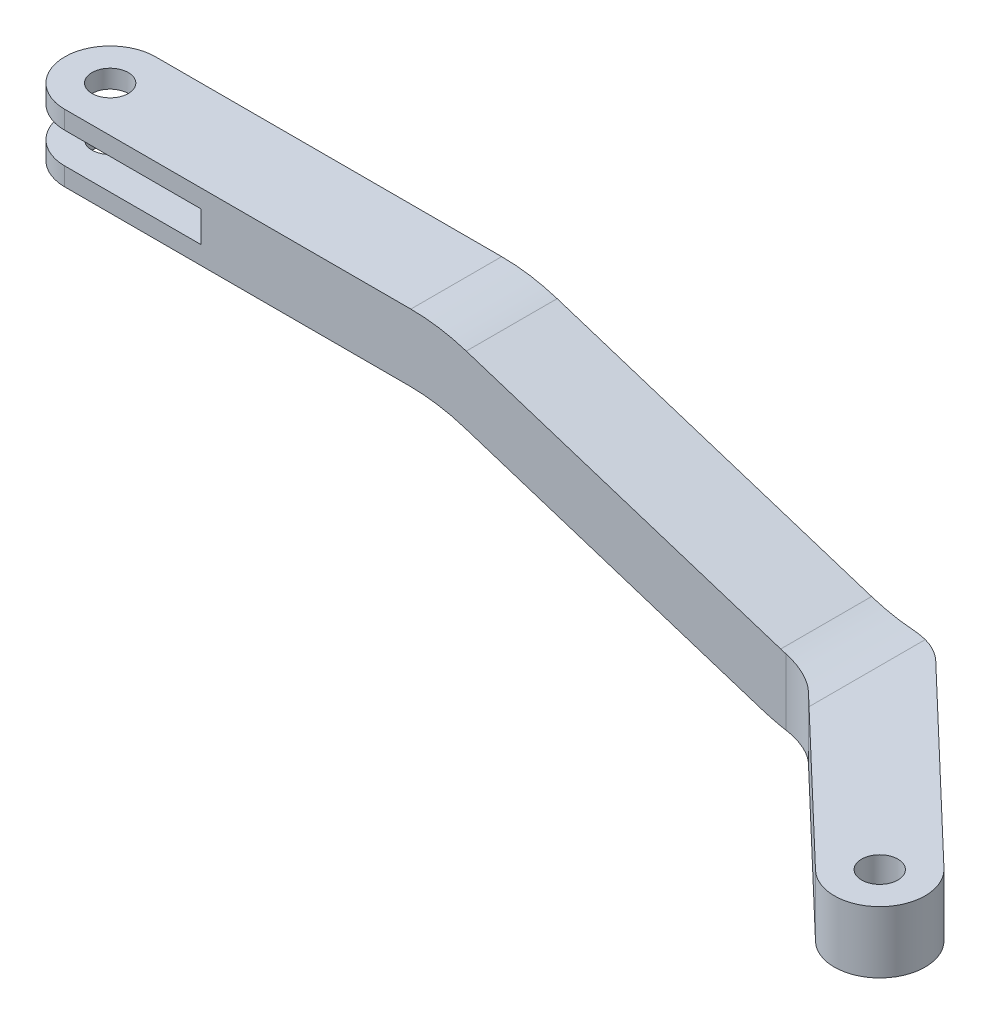
ISO-10303-21;
HEADER;
FILE_DESCRIPTION(('STEP AP214'),'2;1');
FILE_NAME('part.step','',(''),(''),'','','');
FILE_SCHEMA(('AUTOMOTIVE_DESIGN { 1 0 10303 214 1 1 1 1 }'));
ENDSEC;
DATA;
#1=APPLICATION_CONTEXT('core data for automotive mechanical design processes');
#2=APPLICATION_PROTOCOL_DEFINITION('international standard','automotive_design',2000,#1);
#3=PRODUCT_CONTEXT('',#1,'mechanical');
#4=PRODUCT('Part','Part','',(#3));
#5=PRODUCT_RELATED_PRODUCT_CATEGORY('part','',(#4));
#6=PRODUCT_DEFINITION_FORMATION('','',#4);
#7=PRODUCT_DEFINITION_CONTEXT('part definition',#1,'design');
#8=PRODUCT_DEFINITION('design','',#6,#7);
#9=PRODUCT_DEFINITION_SHAPE('','',#8);
#10=(LENGTH_UNIT() NAMED_UNIT(*) SI_UNIT(.MILLI.,.METRE.));
#11=(NAMED_UNIT(*) PLANE_ANGLE_UNIT() SI_UNIT($,.RADIAN.));
#12=(NAMED_UNIT(*) SI_UNIT($,.STERADIAN.) SOLID_ANGLE_UNIT());
#13=UNCERTAINTY_MEASURE_WITH_UNIT(LENGTH_MEASURE(1.E-05),#10,'distance_accuracy_value','');
#14=(GEOMETRIC_REPRESENTATION_CONTEXT(3) GLOBAL_UNCERTAINTY_ASSIGNED_CONTEXT((#13)) GLOBAL_UNIT_ASSIGNED_CONTEXT((#10,
#11,#12)) REPRESENTATION_CONTEXT('',''));
#15=CARTESIAN_POINT('',(0.,0.,0.));
#16=DIRECTION('',(0.,0.,1.));
#17=DIRECTION('',(1.,0.,0.));
#18=AXIS2_PLACEMENT_3D('',#15,#16,#17);
#19=CARTESIAN_POINT('',(-12.2120367770915,-3.4,0.));
#20=DIRECTION('',(0.,1.,0.));
#21=DIRECTION('',(-1.,0.,0.));
#22=AXIS2_PLACEMENT_3D('',#19,#20,#21);
#23=CYLINDRICAL_SURFACE('',#22,2.5);
#24=CARTESIAN_POINT('',(-12.2120367770915,5.5,0.));
#25=DIRECTION('',(0.,1.,0.));
#26=DIRECTION('',(-1.,0.,0.));
#27=AXIS2_PLACEMENT_3D('',#24,#25,#26);
#28=CIRCLE('',#27,2.5);
#29=CARTESIAN_POINT('',(-12.2120367770915,5.5,-2.5));
#30=VERTEX_POINT('',#29);
#31=CARTESIAN_POINT('',(-12.2120367770915,5.5,2.5));
#32=VERTEX_POINT('',#31);
#33=EDGE_CURVE('E342',#30,#32,#28,.T.);
#34=ORIENTED_EDGE('',*,*,#33,.T.);
#35=DIRECTION('',(0.,1.,0.));
#36=VECTOR('',#35,1.);
#37=CARTESIAN_POINT('',(-12.2120367770915,-3.4,2.5));
#38=LINE('',#37,#36);
#39=CARTESIAN_POINT('',(-12.2120367770915,6.5,2.5));
#40=VERTEX_POINT('',#39);
#41=EDGE_CURVE('E313',#32,#40,#38,.T.);
#42=ORIENTED_EDGE('',*,*,#41,.T.);
#43=CARTESIAN_POINT('',(-12.2120367770915,6.5,0.));
#44=DIRECTION('',(0.,1.,0.));
#45=DIRECTION('',(0.,0.,1.));
#46=AXIS2_PLACEMENT_3D('',#43,#44,#45);
#47=CIRCLE('',#46,2.5);
#48=CARTESIAN_POINT('',(-12.2120367770915,6.5,-2.5));
#49=VERTEX_POINT('',#48);
#50=EDGE_CURVE('E272',#49,#40,#47,.T.);
#51=ORIENTED_EDGE('',*,*,#50,.F.);
#52=DIRECTION('',(0.,1.,0.));
#53=VECTOR('',#52,1.);
#54=CARTESIAN_POINT('',(-12.2120367770915,-3.4,-2.5));
#55=LINE('',#54,#53);
#56=EDGE_CURVE('E310',#30,#49,#55,.T.);
#57=ORIENTED_EDGE('',*,*,#56,.F.);
#58=EDGE_LOOP('',(#34,#42,#51,#57));
#59=FACE_BOUND('',#58,.T.);
#60=ADVANCED_FACE('F75',(#59),#23,.T.);
#61=CARTESIAN_POINT('',(-14.7120367770915,6.5,2.5));
#62=DIRECTION('',(0.,-1.,0.));
#63=DIRECTION('',(0.,0.,-1.));
#64=AXIS2_PLACEMENT_3D('',#61,#62,#63);
#65=PLANE('',#64);
#66=CARTESIAN_POINT('',(-12.2120367770915,6.5,0.));
#67=DIRECTION('',(0.,1.,0.));
#68=DIRECTION('',(0.,0.,1.));
#69=AXIS2_PLACEMENT_3D('',#66,#67,#68);
#70=CIRCLE('',#69,1.);
#71=CARTESIAN_POINT('',(-12.2120367770915,6.5,1.));
#72=VERTEX_POINT('',#71);
#73=EDGE_CURVE('E351',#72,#72,#70,.T.);
#74=ORIENTED_EDGE('',*,*,#73,.F.);
#75=EDGE_LOOP('',(#74));
#76=FACE_BOUND('',#75,.T.);
#77=DIRECTION('',(-1.,0.,0.));
#78=VECTOR('',#77,1.);
#79=CARTESIAN_POINT('',(-14.7120367770915,6.5,2.5));
#80=LINE('',#79,#78);
#81=CARTESIAN_POINT('',(6.83456901534812,6.5,2.5));
#82=VERTEX_POINT('',#81);
#83=EDGE_CURVE('E323',#82,#40,#80,.T.);
#84=ORIENTED_EDGE('',*,*,#83,.F.);
#85=DIRECTION('',(0.,0.,-1.));
#86=VECTOR('',#85,1.);
#87=CARTESIAN_POINT('',(6.83456901534812,6.5,2.5));
#88=LINE('',#87,#86);
#89=CARTESIAN_POINT('',(6.83456901534812,6.5,-2.5));
#90=VERTEX_POINT('',#89);
#91=EDGE_CURVE('E389',#82,#90,#88,.T.);
#92=ORIENTED_EDGE('',*,*,#91,.T.);
#93=DIRECTION('',(-1.,0.,0.));
#94=VECTOR('',#93,1.);
#95=CARTESIAN_POINT('',(-14.7120367770915,6.5,-2.5));
#96=LINE('',#95,#94);
#97=EDGE_CURVE('E324',#90,#49,#96,.T.);
#98=ORIENTED_EDGE('',*,*,#97,.T.);
#99=ORIENTED_EDGE('',*,*,#50,.T.);
#100=EDGE_LOOP('',(#84,#92,#98,#99));
#101=FACE_BOUND('',#100,.T.);
#102=ADVANCED_FACE('F501',(#76,#101),#65,.F.);
#103=CARTESIAN_POINT('',(0.,0.,2.5));
#104=DIRECTION('',(0.,0.,-1.));
#105=DIRECTION('',(-1.,0.,0.));
#106=AXIS2_PLACEMENT_3D('',#103,#104,#105);
#107=PLANE('',#106);
#108=CARTESIAN_POINT('',(29.2183524867849,6.6,2.5));
#109=DIRECTION('',(0.,0.,-1.));
#110=DIRECTION('',(-1.,0.,0.));
#111=AXIS2_PLACEMENT_3D('',#108,#109,#110);
#112=CIRCLE('',#111,10.);
#113=CARTESIAN_POINT('',(26.1661656661372,-2.92282288042074,2.5));
#114=VERTEX_POINT('',#113);
#115=CARTESIAN_POINT('',(27.475314839453,-3.24691930300963,2.5));
#116=VERTEX_POINT('',#115);
#117=EDGE_CURVE('E364',#114,#116,#112,.F.);
#118=ORIENTED_EDGE('',*,*,#117,.T.);
#119=DIRECTION('',(0.,1.,0.));
#120=VECTOR('',#119,1.);
#121=CARTESIAN_POINT('',(27.475314839453,0.122966105567588,2.5));
#122=LINE('',#121,#120);
#123=CARTESIAN_POINT('',(27.475314839453,0.390160855420809,2.5));
#124=VERTEX_POINT('',#123);
#125=EDGE_CURVE('E457',#116,#124,#122,.T.);
#126=ORIENTED_EDGE('',*,*,#125,.T.);
#127=CARTESIAN_POINT('',(30.2413574304688,10.,2.5));
#128=DIRECTION('',(0.,0.,-1.));
#129=DIRECTION('',(-1.,0.,0.));
#130=AXIS2_PLACEMENT_3D('',#127,#128,#129);
#131=CIRCLE('',#130,10.);
#132=CARTESIAN_POINT('',(27.1891706098212,0.477177119579267,2.5));
#133=VERTEX_POINT('',#132);
#134=EDGE_CURVE('E406',#124,#133,#131,.T.);
#135=ORIENTED_EDGE('',*,*,#134,.T.);
#136=DIRECTION('',(-0.952282288042073,0.305218682064767,0.));
#137=VECTOR('',#136,1.);
#138=CARTESIAN_POINT('',(8.39796322290848,6.5,2.5));
#139=LINE('',#138,#137);
#140=CARTESIAN_POINT('',(9.88675583599579,6.02282288042073,2.5));
#141=VERTEX_POINT('',#140);
#142=EDGE_CURVE('E319',#133,#141,#139,.T.);
#143=ORIENTED_EDGE('',*,*,#142,.T.);
#144=CARTESIAN_POINT('',(6.83456901534812,-3.5,2.5));
#145=DIRECTION('',(0.,0.,-1.));
#146=DIRECTION('',(-1.,0.,0.));
#147=AXIS2_PLACEMENT_3D('',#144,#145,#146);
#148=CIRCLE('',#147,10.);
#149=EDGE_CURVE('E361',#141,#82,#148,.F.);
#150=ORIENTED_EDGE('',*,*,#149,.T.);
#151=ORIENTED_EDGE('',*,*,#83,.T.);
#152=ORIENTED_EDGE('',*,*,#41,.F.);
#153=DIRECTION('',(-1.,0.,0.));
#154=VECTOR('',#153,1.);
#155=CARTESIAN_POINT('',(-14.7120367770915,5.5,2.5));
#156=LINE('',#155,#154);
#157=CARTESIAN_POINT('',(-4.71203677709152,5.5,2.5));
#158=VERTEX_POINT('',#157);
#159=EDGE_CURVE('E244',#158,#32,#156,.T.);
#160=ORIENTED_EDGE('',*,*,#159,.F.);
#161=DIRECTION('',(0.,1.,0.));
#162=VECTOR('',#161,1.);
#163=CARTESIAN_POINT('',(-4.71203677709152,5.5,2.5));
#164=LINE('',#163,#162);
#165=CARTESIAN_POINT('',(-4.71203677709152,3.8,2.5));
#166=VERTEX_POINT('',#165);
#167=EDGE_CURVE('E248',#166,#158,#164,.T.);
#168=ORIENTED_EDGE('',*,*,#167,.F.);
#169=DIRECTION('',(1.,0.,0.));
#170=VECTOR('',#169,1.);
#171=CARTESIAN_POINT('',(-14.7120367770915,3.8,2.5));
#172=LINE('',#171,#170);
#173=CARTESIAN_POINT('',(-12.2120367770915,3.8,2.5));
#174=VERTEX_POINT('',#173);
#175=EDGE_CURVE('E222',#174,#166,#172,.T.);
#176=ORIENTED_EDGE('',*,*,#175,.F.);
#177=CARTESIAN_POINT('',(-12.2120367770915,2.8,2.5));
#178=VERTEX_POINT('',#177);
#179=EDGE_CURVE('E314',#178,#174,#38,.T.);
#180=ORIENTED_EDGE('',*,*,#179,.F.);
#181=DIRECTION('',(-1.,0.,0.));
#182=VECTOR('',#181,1.);
#183=CARTESIAN_POINT('',(-14.7120367770915,2.8,2.5));
#184=LINE('',#183,#182);
#185=CARTESIAN_POINT('',(6.74756407166418,2.8,2.5));
#186=VERTEX_POINT('',#185);
#187=EDGE_CURVE('E269',#186,#178,#184,.T.);
#188=ORIENTED_EDGE('',*,*,#187,.F.);
#189=CARTESIAN_POINT('',(6.74756407166419,-7.2,2.5));
#190=DIRECTION('',(0.,0.,-1.));
#191=DIRECTION('',(-1.,0.,0.));
#192=AXIS2_PLACEMENT_3D('',#189,#190,#191);
#193=CIRCLE('',#192,10.);
#194=CARTESIAN_POINT('',(9.79975089231186,2.32282288042073,2.5));
#195=VERTEX_POINT('',#194);
#196=EDGE_CURVE('E393',#186,#195,#193,.T.);
#197=ORIENTED_EDGE('',*,*,#196,.T.);
#198=DIRECTION('',(-0.952282288042073,0.305218682064767,0.));
#199=VECTOR('',#198,1.);
#200=CARTESIAN_POINT('',(8.31095827922456,2.8,2.5));
#201=LINE('',#200,#199);
#202=EDGE_CURVE('E262',#114,#195,#201,.T.);
#203=ORIENTED_EDGE('',*,*,#202,.F.);
#204=EDGE_LOOP('',(#118,#126,#135,#143,#150,#151,#152,#160,#168,#176,#180,#188,#197,#203));
#205=FACE_BOUND('',#204,.T.);
#206=ADVANCED_FACE('F490',(#205),#107,.F.);
#207=CARTESIAN_POINT('',(0.,0.,-2.5));
#208=DIRECTION('',(0.,0.,-1.));
#209=DIRECTION('',(-1.,0.,0.));
#210=AXIS2_PLACEMENT_3D('',#207,#208,#209);
#211=PLANE('',#210);
#212=CARTESIAN_POINT('',(30.2413574304688,10.,-2.5));
#213=DIRECTION('',(0.,0.,-1.));
#214=DIRECTION('',(-1.,0.,0.));
#215=AXIS2_PLACEMENT_3D('',#212,#213,#214);
#216=CIRCLE('',#215,10.);
#217=CARTESIAN_POINT('',(27.1891706098212,0.477177119579267,-2.5));
#218=VERTEX_POINT('',#217);
#219=CARTESIAN_POINT('',(29.4797288118788,0.0290460914040627,-2.5));
#220=VERTEX_POINT('',#219);
#221=EDGE_CURVE('E399',#218,#220,#216,.F.);
#222=ORIENTED_EDGE('',*,*,#221,.T.);
#223=DIRECTION('',(0.,1.,0.));
#224=VECTOR('',#223,1.);
#225=CARTESIAN_POINT('',(29.4797288118788,-3.4,-2.5));
#226=LINE('',#225,#224);
#227=CARTESIAN_POINT('',(29.4797288118788,-3.4,-2.5));
#228=VERTEX_POINT('',#227);
#229=EDGE_CURVE('E424',#220,#228,#226,.F.);
#230=ORIENTED_EDGE('',*,*,#229,.T.);
#231=DIRECTION('',(1.,0.,0.));
#232=VECTOR('',#231,1.);
#233=CARTESIAN_POINT('',(-12.2120367770915,-3.4,-2.5));
#234=LINE('',#233,#232);
#235=CARTESIAN_POINT('',(29.2183524867849,-3.4,-2.5));
#236=VERTEX_POINT('',#235);
#237=EDGE_CURVE('E282',#236,#228,#234,.T.);
#238=ORIENTED_EDGE('',*,*,#237,.F.);
#239=CARTESIAN_POINT('',(29.2183524867849,6.6,-2.5));
#240=DIRECTION('',(0.,0.,-1.));
#241=DIRECTION('',(-1.,0.,0.));
#242=AXIS2_PLACEMENT_3D('',#239,#240,#241);
#243=CIRCLE('',#242,10.);
#244=CARTESIAN_POINT('',(26.1661656661372,-2.92282288042074,-2.5));
#245=VERTEX_POINT('',#244);
#246=EDGE_CURVE('E372',#236,#245,#243,.T.);
#247=ORIENTED_EDGE('',*,*,#246,.T.);
#248=DIRECTION('',(-0.952282288042073,0.305218682064767,0.));
#249=VECTOR('',#248,1.);
#250=CARTESIAN_POINT('',(8.31095827922456,2.8,-2.5));
#251=LINE('',#250,#249);
#252=CARTESIAN_POINT('',(9.79975089231186,2.32282288042073,-2.5));
#253=VERTEX_POINT('',#252);
#254=EDGE_CURVE('E264',#245,#253,#251,.T.);
#255=ORIENTED_EDGE('',*,*,#254,.T.);
#256=CARTESIAN_POINT('',(6.74756407166419,-7.2,-2.5));
#257=DIRECTION('',(0.,0.,-1.));
#258=DIRECTION('',(-1.,0.,0.));
#259=AXIS2_PLACEMENT_3D('',#256,#257,#258);
#260=CIRCLE('',#259,10.);
#261=CARTESIAN_POINT('',(6.74756407166418,2.8,-2.5));
#262=VERTEX_POINT('',#261);
#263=EDGE_CURVE('E396',#253,#262,#260,.F.);
#264=ORIENTED_EDGE('',*,*,#263,.T.);
#265=DIRECTION('',(-1.,0.,0.));
#266=VECTOR('',#265,1.);
#267=CARTESIAN_POINT('',(-14.7120367770915,2.8,-2.5));
#268=LINE('',#267,#266);
#269=CARTESIAN_POINT('',(-12.2120367770915,2.8,-2.5));
#270=VERTEX_POINT('',#269);
#271=EDGE_CURVE('E268',#262,#270,#268,.T.);
#272=ORIENTED_EDGE('',*,*,#271,.T.);
#273=CARTESIAN_POINT('',(-12.2120367770915,3.8,-2.5));
#274=VERTEX_POINT('',#273);
#275=EDGE_CURVE('E242',#270,#274,#55,.T.);
#276=ORIENTED_EDGE('',*,*,#275,.T.);
#277=DIRECTION('',(1.,0.,0.));
#278=VECTOR('',#277,1.);
#279=CARTESIAN_POINT('',(-14.7120367770915,3.8,-2.5));
#280=LINE('',#279,#278);
#281=CARTESIAN_POINT('',(-4.71203677709152,3.8,-2.5));
#282=VERTEX_POINT('',#281);
#283=EDGE_CURVE('E219',#274,#282,#280,.T.);
#284=ORIENTED_EDGE('',*,*,#283,.T.);
#285=DIRECTION('',(0.,1.,0.));
#286=VECTOR('',#285,1.);
#287=CARTESIAN_POINT('',(-4.71203677709152,5.5,-2.5));
#288=LINE('',#287,#286);
#289=CARTESIAN_POINT('',(-4.71203677709152,5.5,-2.5));
#290=VERTEX_POINT('',#289);
#291=EDGE_CURVE('E231',#282,#290,#288,.T.);
#292=ORIENTED_EDGE('',*,*,#291,.T.);
#293=DIRECTION('',(-1.,0.,0.));
#294=VECTOR('',#293,1.);
#295=CARTESIAN_POINT('',(-14.7120367770915,5.5,-2.5));
#296=LINE('',#295,#294);
#297=EDGE_CURVE('E228',#290,#30,#296,.T.);
#298=ORIENTED_EDGE('',*,*,#297,.T.);
#299=ORIENTED_EDGE('',*,*,#56,.T.);
#300=ORIENTED_EDGE('',*,*,#97,.F.);
#301=CARTESIAN_POINT('',(6.83456901534812,-3.5,-2.5));
#302=DIRECTION('',(0.,0.,-1.));
#303=DIRECTION('',(-1.,0.,0.));
#304=AXIS2_PLACEMENT_3D('',#301,#302,#303);
#305=CIRCLE('',#304,10.);
#306=CARTESIAN_POINT('',(9.88675583599579,6.02282288042073,-2.5));
#307=VERTEX_POINT('',#306);
#308=EDGE_CURVE('E369',#90,#307,#305,.T.);
#309=ORIENTED_EDGE('',*,*,#308,.T.);
#310=DIRECTION('',(-0.952282288042073,0.305218682064767,0.));
#311=VECTOR('',#310,1.);
#312=CARTESIAN_POINT('',(8.39796322290848,6.5,-2.5));
#313=LINE('',#312,#311);
#314=EDGE_CURVE('E318',#218,#307,#313,.T.);
#315=ORIENTED_EDGE('',*,*,#314,.F.);
#316=EDGE_LOOP('',(#222,#230,#238,#247,#255,#264,#272,#276,#284,#292,#298,#299,#300,#309,#315));
#317=FACE_BOUND('',#316,.T.);
#318=ADVANCED_FACE('F240',(#317),#211,.T.);
#319=CARTESIAN_POINT('',(8.39796322290848,6.5,2.5));
#320=DIRECTION('',(-0.305218682064767,-0.952282288042073,0.));
#321=DIRECTION('',(0.952282288042074,-0.305218682064767,0.));
#322=AXIS2_PLACEMENT_3D('',#319,#320,#321);
#323=PLANE('',#322);
#324=ORIENTED_EDGE('',*,*,#142,.F.);
#325=DIRECTION('',(0.,0.,-1.));
#326=VECTOR('',#325,1.);
#327=CARTESIAN_POINT('',(27.1891706098212,0.477177119579267,-2.5));
#328=LINE('',#327,#326);
#329=EDGE_CURVE('E382',#133,#218,#328,.T.);
#330=ORIENTED_EDGE('',*,*,#329,.T.);
#331=ORIENTED_EDGE('',*,*,#314,.T.);
#332=DIRECTION('',(0.,0.,-1.));
#333=VECTOR('',#332,1.);
#334=CARTESIAN_POINT('',(9.88675583599579,6.02282288042073,2.5));
#335=LINE('',#334,#333);
#336=EDGE_CURVE('E379',#307,#141,#335,.F.);
#337=ORIENTED_EDGE('',*,*,#336,.T.);
#338=EDGE_LOOP('',(#324,#330,#331,#337));
#339=FACE_BOUND('',#338,.T.);
#340=ADVANCED_FACE('F493',(#339),#323,.F.);
#341=CARTESIAN_POINT('',(28.6779632229085,-3.4,2.5));
#342=DIRECTION('',(0.690756218983956,0.,-0.723087716625714));
#343=DIRECTION('',(-0.723087716625714,0.,-0.690756218983956));
#344=AXIS2_PLACEMENT_3D('',#341,#342,#343);
#345=PLANE('',#344);
#346=CARTESIAN_POINT('',(30.2413574304688,10.,3.99348999680879));
#347=DIRECTION('',(0.690756218983956,0.,-0.723087716625714));
#348=DIRECTION('',(0.723087716625714,0.,0.690756218983956));
#349=AXIS2_PLACEMENT_3D('',#346,#347,#348);
#350=ELLIPSE('',#349,13.8295807964557,10.);
#351=CARTESIAN_POINT('',(30.2413574304688,0.,3.99348999680879));
#352=VERTEX_POINT('',#351);
#353=CARTESIAN_POINT('',(29.5475834964049,0.0240951423736285,3.33073685012286));
#354=VERTEX_POINT('',#353);
#355=EDGE_CURVE('E402',#352,#354,#350,.T.);
#356=ORIENTED_EDGE('',*,*,#355,.T.);
#357=DIRECTION('',(0.,1.,0.));
#358=VECTOR('',#357,1.);
#359=CARTESIAN_POINT('',(29.5475834964049,-3.38538829708124,3.33073685012286));
#360=LINE('',#359,#358);
#361=CARTESIAN_POINT('',(29.5475834964049,-3.4,3.33073685012286));
#362=VERTEX_POINT('',#361);
#363=EDGE_CURVE('E445',#354,#362,#360,.F.);
#364=ORIENTED_EDGE('',*,*,#363,.T.);
#365=DIRECTION('',(-0.723087716625714,0.,-0.690756218983956));
#366=VECTOR('',#365,1.);
#367=CARTESIAN_POINT('',(28.6779632229085,-3.4,2.5));
#368=LINE('',#367,#366);
#369=CARTESIAN_POINT('',(38.2227210823679,-3.4,11.6179820905882));
#370=VERTEX_POINT('',#369);
#371=EDGE_CURVE('E278',#370,#362,#368,.T.);
#372=ORIENTED_EDGE('',*,*,#371,.F.);
#373=DIRECTION('',(0.,1.,0.));
#374=VECTOR('',#373,1.);
#375=CARTESIAN_POINT('',(38.2227210823679,-3.4,11.6179820905882));
#376=LINE('',#375,#374);
#377=CARTESIAN_POINT('',(38.2227210823679,0.,11.6179820905882));
#378=VERTEX_POINT('',#377);
#379=EDGE_CURVE('E293',#370,#378,#376,.T.);
#380=ORIENTED_EDGE('',*,*,#379,.T.);
#381=DIRECTION('',(-0.723087716625714,0.,-0.690756218983956));
#382=VECTOR('',#381,1.);
#383=CARTESIAN_POINT('',(28.6779632229085,0.,2.5));
#384=LINE('',#383,#382);
#385=EDGE_CURVE('E294',#378,#352,#384,.T.);
#386=ORIENTED_EDGE('',*,*,#385,.T.);
#387=EDGE_LOOP('',(#356,#364,#372,#380,#386));
#388=FACE_BOUND('',#387,.T.);
#389=ADVANCED_FACE('F486',(#388),#345,.F.);
#390=ORIENTED_EDGE('',*,*,#179,.T.);
#391=CARTESIAN_POINT('',(-12.2120367770915,3.8,0.));
#392=DIRECTION('',(0.,-1.,0.));
#393=DIRECTION('',(0.,0.,-1.));
#394=AXIS2_PLACEMENT_3D('',#391,#392,#393);
#395=CIRCLE('',#394,2.5);
#396=EDGE_CURVE('E339',#174,#274,#395,.T.);
#397=ORIENTED_EDGE('',*,*,#396,.T.);
#398=ORIENTED_EDGE('',*,*,#275,.F.);
#399=CARTESIAN_POINT('',(-12.2120367770915,2.8,0.));
#400=DIRECTION('',(0.,1.,0.));
#401=DIRECTION('',(0.,0.,1.));
#402=AXIS2_PLACEMENT_3D('',#399,#400,#401);
#403=CIRCLE('',#402,2.5);
#404=EDGE_CURVE('E327',#270,#178,#403,.T.);
#405=ORIENTED_EDGE('',*,*,#404,.T.);
#406=EDGE_LOOP('',(#390,#397,#398,#405));
#407=FACE_BOUND('',#406,.T.);
#408=ADVANCED_FACE('F515',(#407),#23,.T.);
#409=CARTESIAN_POINT('',(41.6765021772877,-3.4,8.00254350745964));
#410=DIRECTION('',(-0.690756218983956,0.,0.723087716625714));
#411=DIRECTION('',(0.723087716625714,0.,0.690756218983956));
#412=AXIS2_PLACEMENT_3D('',#409,#410,#411);
#413=PLANE('',#412);
#414=DIRECTION('',(0.723087716625714,0.,0.690756218983956));
#415=VECTOR('',#414,1.);
#416=CARTESIAN_POINT('',(41.6765021772877,-3.4,8.00254350745964));
#417=LINE('',#416,#415);
#418=CARTESIAN_POINT('',(31.5519974688306,-3.4,-1.66926314987715));
#419=VERTEX_POINT('',#418);
#420=CARTESIAN_POINT('',(41.6765021772877,-3.4,8.00254350745964));
#421=VERTEX_POINT('',#420);
#422=EDGE_CURVE('E287',#419,#421,#417,.T.);
#423=ORIENTED_EDGE('',*,*,#422,.F.);
#424=DIRECTION('',(0.,1.,0.));
#425=VECTOR('',#424,1.);
#426=CARTESIAN_POINT('',(31.5519974688306,0.,-1.66926314987714));
#427=LINE('',#426,#425);
#428=CARTESIAN_POINT('',(31.5519974688306,0.,-1.66926314987715));
#429=VERTEX_POINT('',#428);
#430=EDGE_CURVE('E409',#419,#429,#427,.T.);
#431=ORIENTED_EDGE('',*,*,#430,.T.);
#432=DIRECTION('',(0.723087716625714,0.,0.690756218983956));
#433=VECTOR('',#432,1.);
#434=CARTESIAN_POINT('',(41.6765021772877,0.,8.00254350745964));
#435=LINE('',#434,#433);
#436=CARTESIAN_POINT('',(41.6765021772877,0.,8.00254350745964));
#437=VERTEX_POINT('',#436);
#438=EDGE_CURVE('E298',#429,#437,#435,.T.);
#439=ORIENTED_EDGE('',*,*,#438,.T.);
#440=DIRECTION('',(0.,1.,0.));
#441=VECTOR('',#440,1.);
#442=CARTESIAN_POINT('',(41.6765021772877,-3.4,8.00254350745964));
#443=LINE('',#442,#441);
#444=EDGE_CURVE('E306',#421,#437,#443,.T.);
#445=ORIENTED_EDGE('',*,*,#444,.F.);
#446=EDGE_LOOP('',(#423,#431,#439,#445));
#447=FACE_BOUND('',#446,.T.);
#448=ADVANCED_FACE('F474',(#447),#413,.F.);
#449=CARTESIAN_POINT('',(39.9496116298278,-3.4,9.81026279902392));
#450=DIRECTION('',(0.,1.,0.));
#451=DIRECTION('',(-1.,0.,0.));
#452=AXIS2_PLACEMENT_3D('',#449,#450,#451);
#453=CYLINDRICAL_SURFACE('',#452,2.5);
#454=CARTESIAN_POINT('',(39.9496116298278,0.,9.81026279902392));
#455=DIRECTION('',(0.,-1.,0.));
#456=DIRECTION('',(1.,0.,0.));
#457=AXIS2_PLACEMENT_3D('',#454,#455,#456);
#458=CIRCLE('',#457,2.5);
#459=EDGE_CURVE('E283',#437,#378,#458,.T.);
#460=ORIENTED_EDGE('',*,*,#459,.T.);
#461=ORIENTED_EDGE('',*,*,#379,.F.);
#462=CARTESIAN_POINT('',(39.9496116298278,-3.4,9.81026279902392));
#463=DIRECTION('',(0.,-1.,0.));
#464=DIRECTION('',(1.,0.,0.));
#465=AXIS2_PLACEMENT_3D('',#462,#463,#464);
#466=CIRCLE('',#465,2.5);
#467=EDGE_CURVE('E290',#421,#370,#466,.T.);
#468=ORIENTED_EDGE('',*,*,#467,.F.);
#469=ORIENTED_EDGE('',*,*,#444,.T.);
#470=EDGE_LOOP('',(#460,#461,#468,#469));
#471=FACE_BOUND('',#470,.T.);
#472=ADVANCED_FACE('F483',(#471),#453,.T.);
#473=CARTESIAN_POINT('',(39.9496116298278,-3.4,9.81026279902392));
#474=DIRECTION('',(0.,-1.,0.));
#475=DIRECTION('',(1.,0.,0.));
#476=AXIS2_PLACEMENT_3D('',#473,#474,#475);
#477=PLANE('',#476);
#478=CARTESIAN_POINT('',(39.9496116298278,-3.4,9.81026279902392));
#479=DIRECTION('',(0.,1.,0.));
#480=DIRECTION('',(0.,0.,1.));
#481=AXIS2_PLACEMENT_3D('',#478,#479,#480);
#482=CIRCLE('',#481,0.999999999999998);
#483=CARTESIAN_POINT('',(39.9496116298278,-3.4,10.8102627990239));
#484=VERTEX_POINT('',#483);
#485=EDGE_CURVE('E742',#484,#484,#482,.T.);
#486=ORIENTED_EDGE('',*,*,#485,.T.);
#487=EDGE_LOOP('',(#486));
#488=FACE_BOUND('',#487,.T.);
#489=ORIENTED_EDGE('',*,*,#237,.T.);
#490=CARTESIAN_POINT('',(29.4797288118788,-3.4,0.5));
#491=DIRECTION('',(0.,-1.,0.));
#492=DIRECTION('',(1.,0.,0.));
#493=AXIS2_PLACEMENT_3D('',#490,#491,#492);
#494=CIRCLE('',#493,3.);
#495=EDGE_CURVE('E461',#228,#419,#494,.T.);
#496=ORIENTED_EDGE('',*,*,#495,.T.);
#497=ORIENTED_EDGE('',*,*,#422,.T.);
#498=ORIENTED_EDGE('',*,*,#467,.T.);
#499=ORIENTED_EDGE('',*,*,#371,.T.);
#500=CARTESIAN_POINT('',(27.475314839453,-3.4,5.5));
#501=DIRECTION('',(0.,-1.,0.));
#502=DIRECTION('',(1.,0.,0.));
#503=AXIS2_PLACEMENT_3D('',#500,#501,#502);
#504=CIRCLE('',#503,3.);
#505=CARTESIAN_POINT('',(29.2183524867849,-3.4,3.05831620393029));
#506=VERTEX_POINT('',#505);
#507=EDGE_CURVE('E90',#362,#506,#504,.F.);
#508=ORIENTED_EDGE('',*,*,#507,.T.);
#509=DIRECTION('',(0.,0.,1.));
#510=VECTOR('',#509,1.);
#511=CARTESIAN_POINT('',(29.2183524867849,-3.4,-2.5));
#512=LINE('',#511,#510);
#513=EDGE_CURVE('E96',#506,#236,#512,.F.);
#514=ORIENTED_EDGE('',*,*,#513,.T.);
#515=EDGE_LOOP('',(#489,#496,#497,#498,#499,#508,#514));
#516=FACE_BOUND('',#515,.T.);
#517=ADVANCED_FACE('F450',(#488,#516),#477,.T.);
#518=CARTESIAN_POINT('',(39.9496116298278,0.,9.81026279902392));
#519=DIRECTION('',(0.,-1.,0.));
#520=DIRECTION('',(1.,0.,0.));
#521=AXIS2_PLACEMENT_3D('',#518,#519,#520);
#522=PLANE('',#521);
#523=CARTESIAN_POINT('',(39.9496116298278,0.,9.81026279902392));
#524=DIRECTION('',(0.,-1.,0.));
#525=DIRECTION('',(1.,0.,0.));
#526=AXIS2_PLACEMENT_3D('',#523,#524,#525);
#527=CIRCLE('',#526,0.999999999999998);
#528=CARTESIAN_POINT('',(40.9496116298278,0.,9.81026279902392));
#529=VERTEX_POINT('',#528);
#530=EDGE_CURVE('E258',#529,#529,#527,.T.);
#531=ORIENTED_EDGE('',*,*,#530,.T.);
#532=EDGE_LOOP('',(#531));
#533=FACE_BOUND('',#532,.T.);
#534=ORIENTED_EDGE('',*,*,#438,.F.);
#535=CARTESIAN_POINT('',(29.4797288118788,0.,0.5));
#536=DIRECTION('',(0.,-1.,0.));
#537=DIRECTION('',(1.,0.,0.));
#538=AXIS2_PLACEMENT_3D('',#535,#536,#537);
#539=CIRCLE('',#538,3.);
#540=CARTESIAN_POINT('',(30.2413574304688,0.,-2.40171015908629));
#541=VERTEX_POINT('',#540);
#542=EDGE_CURVE('E413',#429,#541,#539,.F.);
#543=ORIENTED_EDGE('',*,*,#542,.T.);
#544=DIRECTION('',(0.,0.,-1.));
#545=VECTOR('',#544,1.);
#546=CARTESIAN_POINT('',(30.2413574304688,0.,2.5));
#547=LINE('',#546,#545);
#548=EDGE_CURVE('E386',#541,#352,#547,.F.);
#549=ORIENTED_EDGE('',*,*,#548,.T.);
#550=ORIENTED_EDGE('',*,*,#385,.F.);
#551=ORIENTED_EDGE('',*,*,#459,.F.);
#552=EDGE_LOOP('',(#534,#543,#549,#550,#551));
#553=FACE_BOUND('',#552,.T.);
#554=ADVANCED_FACE('F478',(#533,#553),#522,.F.);
#555=CARTESIAN_POINT('',(-14.7120367770915,2.8,-2.5));
#556=DIRECTION('',(0.,1.,0.));
#557=DIRECTION('',(0.,0.,1.));
#558=AXIS2_PLACEMENT_3D('',#555,#556,#557);
#559=PLANE('',#558);
#560=CARTESIAN_POINT('',(-12.2120367770915,2.8,0.));
#561=DIRECTION('',(0.,1.,0.));
#562=DIRECTION('',(0.,0.,1.));
#563=AXIS2_PLACEMENT_3D('',#560,#561,#562);
#564=CIRCLE('',#563,1.);
#565=CARTESIAN_POINT('',(-12.2120367770915,2.8,1.));
#566=VERTEX_POINT('',#565);
#567=EDGE_CURVE('E251',#566,#566,#564,.T.);
#568=ORIENTED_EDGE('',*,*,#567,.T.);
#569=EDGE_LOOP('',(#568));
#570=FACE_BOUND('',#569,.T.);
#571=ORIENTED_EDGE('',*,*,#271,.F.);
#572=DIRECTION('',(0.,0.,1.));
#573=VECTOR('',#572,1.);
#574=CARTESIAN_POINT('',(6.74756407166419,2.8,2.5));
#575=LINE('',#574,#573);
#576=EDGE_CURVE('E375',#262,#186,#575,.T.);
#577=ORIENTED_EDGE('',*,*,#576,.T.);
#578=ORIENTED_EDGE('',*,*,#187,.T.);
#579=ORIENTED_EDGE('',*,*,#404,.F.);
#580=EDGE_LOOP('',(#571,#577,#578,#579));
#581=FACE_BOUND('',#580,.T.);
#582=ADVANCED_FACE('F519',(#570,#581),#559,.F.);
#583=CARTESIAN_POINT('',(8.31095827922456,2.8,-2.5));
#584=DIRECTION('',(0.305218682064767,0.952282288042074,0.));
#585=DIRECTION('',(-0.952282288042074,0.305218682064767,0.));
#586=AXIS2_PLACEMENT_3D('',#583,#584,#585);
#587=PLANE('',#586);
#588=ORIENTED_EDGE('',*,*,#254,.F.);
#589=DIRECTION('',(0.,0.,1.));
#590=VECTOR('',#589,1.);
#591=CARTESIAN_POINT('',(26.1661656661372,-2.92282288042074,2.5));
#592=LINE('',#591,#590);
#593=EDGE_CURVE('E357',#245,#114,#592,.T.);
#594=ORIENTED_EDGE('',*,*,#593,.T.);
#595=ORIENTED_EDGE('',*,*,#202,.T.);
#596=DIRECTION('',(0.,0.,1.));
#597=VECTOR('',#596,1.);
#598=CARTESIAN_POINT('',(9.79975089231186,2.32282288042073,-2.5));
#599=LINE('',#598,#597);
#600=EDGE_CURVE('E345',#195,#253,#599,.F.);
#601=ORIENTED_EDGE('',*,*,#600,.T.);
#602=EDGE_LOOP('',(#588,#594,#595,#601));
#603=FACE_BOUND('',#602,.T.);
#604=ADVANCED_FACE('F526',(#603),#587,.F.);
#605=CARTESIAN_POINT('',(-14.7120367770915,5.5,-2.5));
#606=DIRECTION('',(0.,1.,0.));
#607=DIRECTION('',(-1.,0.,0.));
#608=AXIS2_PLACEMENT_3D('',#605,#606,#607);
#609=PLANE('',#608);
#610=CARTESIAN_POINT('',(-12.2120367770915,5.5,0.));
#611=DIRECTION('',(0.,1.,0.));
#612=DIRECTION('',(-1.,0.,0.));
#613=AXIS2_PLACEMENT_3D('',#610,#611,#612);
#614=CIRCLE('',#613,1.);
#615=CARTESIAN_POINT('',(-13.2120367770915,5.5,0.));
#616=VERTEX_POINT('',#615);
#617=EDGE_CURVE('E350',#616,#616,#614,.T.);
#618=ORIENTED_EDGE('',*,*,#617,.T.);
#619=EDGE_LOOP('',(#618));
#620=FACE_BOUND('',#619,.T.);
#621=ORIENTED_EDGE('',*,*,#33,.F.);
#622=ORIENTED_EDGE('',*,*,#297,.F.);
#623=DIRECTION('',(0.,0.,1.));
#624=VECTOR('',#623,1.);
#625=CARTESIAN_POINT('',(-4.71203677709152,5.5,-2.5));
#626=LINE('',#625,#624);
#627=EDGE_CURVE('E227',#290,#158,#626,.T.);
#628=ORIENTED_EDGE('',*,*,#627,.T.);
#629=ORIENTED_EDGE('',*,*,#159,.T.);
#630=EDGE_LOOP('',(#621,#622,#628,#629));
#631=FACE_BOUND('',#630,.T.);
#632=ADVANCED_FACE('F511',(#620,#631),#609,.F.);
#633=CARTESIAN_POINT('',(-14.7120367770915,3.8,-2.5));
#634=DIRECTION('',(0.,-1.,0.));
#635=DIRECTION('',(0.,0.,-1.));
#636=AXIS2_PLACEMENT_3D('',#633,#634,#635);
#637=PLANE('',#636);
#638=CARTESIAN_POINT('',(-12.2120367770915,3.8,0.));
#639=DIRECTION('',(0.,-1.,0.));
#640=DIRECTION('',(0.,0.,-1.));
#641=AXIS2_PLACEMENT_3D('',#638,#639,#640);
#642=CIRCLE('',#641,1.);
#643=CARTESIAN_POINT('',(-12.2120367770915,3.8,-1.));
#644=VERTEX_POINT('',#643);
#645=EDGE_CURVE('E346',#644,#644,#642,.T.);
#646=ORIENTED_EDGE('',*,*,#645,.T.);
#647=EDGE_LOOP('',(#646));
#648=FACE_BOUND('',#647,.T.);
#649=ORIENTED_EDGE('',*,*,#175,.T.);
#650=DIRECTION('',(0.,0.,1.));
#651=VECTOR('',#650,1.);
#652=CARTESIAN_POINT('',(-4.71203677709152,3.8,-2.5));
#653=LINE('',#652,#651);
#654=EDGE_CURVE('E215',#282,#166,#653,.T.);
#655=ORIENTED_EDGE('',*,*,#654,.F.);
#656=ORIENTED_EDGE('',*,*,#283,.F.);
#657=ORIENTED_EDGE('',*,*,#396,.F.);
#658=EDGE_LOOP('',(#649,#655,#656,#657));
#659=FACE_BOUND('',#658,.T.);
#660=ADVANCED_FACE('F217',(#648,#659),#637,.F.);
#661=CARTESIAN_POINT('',(-4.71203677709152,5.5,-2.5));
#662=DIRECTION('',(1.,0.,0.));
#663=DIRECTION('',(0.,0.,-1.));
#664=AXIS2_PLACEMENT_3D('',#661,#662,#663);
#665=PLANE('',#664);
#666=ORIENTED_EDGE('',*,*,#167,.T.);
#667=ORIENTED_EDGE('',*,*,#627,.F.);
#668=ORIENTED_EDGE('',*,*,#291,.F.);
#669=ORIENTED_EDGE('',*,*,#654,.T.);
#670=EDGE_LOOP('',(#666,#667,#668,#669));
#671=FACE_BOUND('',#670,.T.);
#672=ADVANCED_FACE('F232',(#671),#665,.F.);
#673=CARTESIAN_POINT('',(-12.2120367770915,-3.4,0.));
#674=DIRECTION('',(0.,1.,0.));
#675=DIRECTION('',(0.,0.,1.));
#676=AXIS2_PLACEMENT_3D('',#673,#674,#675);
#677=CYLINDRICAL_SURFACE('',#676,1.);
#678=ORIENTED_EDGE('',*,*,#645,.F.);
#679=EDGE_LOOP('',(#678));
#680=FACE_BOUND('',#679,.T.);
#681=ORIENTED_EDGE('',*,*,#567,.F.);
#682=EDGE_LOOP('',(#681));
#683=FACE_BOUND('',#682,.T.);
#684=ADVANCED_FACE('F644',(#680,#683),#677,.F.);
#685=ORIENTED_EDGE('',*,*,#73,.T.);
#686=EDGE_LOOP('',(#685));
#687=FACE_BOUND('',#686,.T.);
#688=ORIENTED_EDGE('',*,*,#617,.F.);
#689=EDGE_LOOP('',(#688));
#690=FACE_BOUND('',#689,.T.);
#691=ADVANCED_FACE('F536',(#687,#690),#677,.F.);
#692=CARTESIAN_POINT('',(39.9496116298278,-3.4,9.81026279902392));
#693=DIRECTION('',(0.,1.,0.));
#694=DIRECTION('',(0.,0.,1.));
#695=AXIS2_PLACEMENT_3D('',#692,#693,#694);
#696=CYLINDRICAL_SURFACE('',#695,0.999999999999998);
#697=ORIENTED_EDGE('',*,*,#485,.F.);
#698=EDGE_LOOP('',(#697));
#699=FACE_BOUND('',#698,.T.);
#700=ORIENTED_EDGE('',*,*,#530,.F.);
#701=EDGE_LOOP('',(#700));
#702=FACE_BOUND('',#701,.T.);
#703=ADVANCED_FACE('F531',(#699,#702),#696,.F.);
#704=CARTESIAN_POINT('',(29.2183524867849,6.6,-2.5));
#705=DIRECTION('',(0.,0.,-1.));
#706=DIRECTION('',(-1.,0.,0.));
#707=AXIS2_PLACEMENT_3D('',#704,#705,#706);
#708=CYLINDRICAL_SURFACE('',#707,10.);
#709=ORIENTED_EDGE('',*,*,#246,.F.);
#710=ORIENTED_EDGE('',*,*,#513,.F.);
#711=CARTESIAN_POINT('',(29.2183524867849,-3.4,3.05831620393029));
#712=CARTESIAN_POINT('',(29.1509119529639,-3.40000531596292,3.01016065171007));
#713=CARTESIAN_POINT('',(29.0814645003869,-3.39931795333207,2.96481498798699));
#714=CARTESIAN_POINT('',(28.9390783833547,-3.39635180579772,2.88002905779849));
#715=CARTESIAN_POINT('',(28.8661394169544,-3.39407288302409,2.8405893032965));
#716=CARTESIAN_POINT('',(28.7192703127838,-3.38780140881711,2.76886908627343));
#717=CARTESIAN_POINT('',(28.6454172379171,-3.38385570838405,2.73642704302893));
#718=CARTESIAN_POINT('',(28.4954808096178,-3.37412225548098,2.67763306557712));
#719=CARTESIAN_POINT('',(28.4193978125044,-3.36833479586445,2.65128016429984));
#720=CARTESIAN_POINT('',(28.2030836628139,-3.3493061662828,2.58598586479935));
#721=CARTESIAN_POINT('',(28.060802447442,-3.33382437949582,2.554133791222));
#722=CARTESIAN_POINT('',(27.8441086256163,-3.30540176009458,2.52182398310187));
#723=CARTESIAN_POINT('',(27.7704138470048,-3.29489974028689,2.51363140227675));
#724=CARTESIAN_POINT('',(27.6228797862125,-3.27218520953948,2.5027201602626));
#725=CARTESIAN_POINT('',(27.5490404997548,-3.25997264719592,2.5000016636141));
#726=CARTESIAN_POINT('',(27.475314839453,-3.24691930300963,2.5));
#727=B_SPLINE_CURVE_WITH_KNOTS('',3,(#711,#712,#713,#714,#715,#716,#717,#718,#719,#720,#721,
#722,#723,#724,#725,#726),.UNSPECIFIED.,.F.,.F.,(4,2,2,2,2,2,2,4),(0.,0.248531395832716,
0.497084323560662,0.739072352389635,0.98102192252367,1.41891743537851,1.64340222185337,
1.86789375581181),.UNSPECIFIED.);
#728=EDGE_CURVE('E12',#506,#116,#727,.T.);
#729=ORIENTED_EDGE('',*,*,#728,.T.);
#730=ORIENTED_EDGE('',*,*,#117,.F.);
#731=ORIENTED_EDGE('',*,*,#593,.F.);
#732=EDGE_LOOP('',(#709,#710,#729,#730,#731));
#733=FACE_BOUND('',#732,.T.);
#734=ADVANCED_FACE('F529',(#733),#708,.T.);
#735=CARTESIAN_POINT('',(6.74756407166419,-7.2,-2.5));
#736=DIRECTION('',(0.,0.,-1.));
#737=DIRECTION('',(-1.,0.,0.));
#738=AXIS2_PLACEMENT_3D('',#735,#736,#737);
#739=CYLINDRICAL_SURFACE('',#738,10.);
#740=ORIENTED_EDGE('',*,*,#263,.F.);
#741=ORIENTED_EDGE('',*,*,#600,.F.);
#742=ORIENTED_EDGE('',*,*,#196,.F.);
#743=ORIENTED_EDGE('',*,*,#576,.F.);
#744=EDGE_LOOP('',(#740,#741,#742,#743));
#745=FACE_BOUND('',#744,.T.);
#746=ADVANCED_FACE('F434',(#745),#739,.F.);
#747=CARTESIAN_POINT('',(30.2413574304688,10.,2.5));
#748=DIRECTION('',(0.,0.,1.));
#749=DIRECTION('',(1.,0.,0.));
#750=AXIS2_PLACEMENT_3D('',#747,#748,#749);
#751=CYLINDRICAL_SURFACE('',#750,10.);
#752=ORIENTED_EDGE('',*,*,#548,.F.);
#753=CARTESIAN_POINT('',(30.2413574304688,0.,-2.40171015908629));
#754=CARTESIAN_POINT('',(30.1790913738683,-3.27227892859491E-06,-2.41805748747371));
#755=CARTESIAN_POINT('',(30.1162971145325,0.000581557869650005,-2.43239313200092));
#756=CARTESIAN_POINT('',(29.9902209359387,0.00295685052948932,-2.45694065981515));
#757=CARTESIAN_POINT('',(29.9269424383412,0.00474192703917974,-2.4671706408366));
#758=CARTESIAN_POINT('',(29.7999062785972,0.00954651764321102,-2.48355292105959));
#759=CARTESIAN_POINT('',(29.7361486164331,0.0125660317828797,-2.4897052201114));
#760=CARTESIAN_POINT('',(29.608154793815,0.0198597638639936,-2.49793988080585));
#761=CARTESIAN_POINT('',(29.5439177691125,0.0241395393866334,-2.50000389535706));
#762=CARTESIAN_POINT('',(29.4797288118788,0.0290460914040626,-2.5));
#763=B_SPLINE_CURVE_WITH_KNOTS('',3,(#753,#754,#755,#756,#757,#758,#759,#760,#761,#762),
.UNSPECIFIED.,.F.,.F.,(4,2,2,2,4),(0.,0.193092676877202,0.385324599270181,0.577556528721797,
0.770649204847683),.UNSPECIFIED.);
#764=EDGE_CURVE('E416',#541,#220,#763,.T.);
#765=ORIENTED_EDGE('',*,*,#764,.T.);
#766=ORIENTED_EDGE('',*,*,#221,.F.);
#767=ORIENTED_EDGE('',*,*,#329,.F.);
#768=ORIENTED_EDGE('',*,*,#134,.F.);
#769=CARTESIAN_POINT('',(27.475314839453,0.390160855420809,2.5));
#770=CARTESIAN_POINT('',(27.5554325725515,0.36709054229629,2.49999110131722));
#771=CARTESIAN_POINT('',(27.6358502118278,0.345038053468239,2.50320960199344));
#772=CARTESIAN_POINT('',(27.7967317145483,0.3030587501535,2.51617821973597));
#773=CARTESIAN_POINT('',(27.8771955843246,0.283132415660244,2.52592980808858));
#774=CARTESIAN_POINT('',(28.0376608657486,0.245486802249759,2.55205476304958));
#775=CARTESIAN_POINT('',(28.1176617241343,0.227769787509603,2.56843485095953));
#776=CARTESIAN_POINT('',(28.2764696283567,0.19460306078388,2.60779464221154));
#777=CARTESIAN_POINT('',(28.3552768246148,0.17915306094899,2.63077350659067));
#778=CARTESIAN_POINT('',(28.5892819970907,0.136140900457428,2.70963421498883));
#779=CARTESIAN_POINT('',(28.7418970034706,0.11195509268508,2.77541336158867));
#780=CARTESIAN_POINT('',(29.0346387523412,0.0719758095495545,2.93173721525959));
#781=CARTESIAN_POINT('',(29.1747934437325,0.0561631364185279,3.02222454289603));
#782=CARTESIAN_POINT('',(29.3484852345485,0.039850740973129,3.15605952419716));
#783=CARTESIAN_POINT('',(29.3896015308017,0.0362583503161815,3.18951852426743));
#784=CARTESIAN_POINT('',(29.4699856327299,0.0297140449727062,3.25855315836674));
#785=CARTESIAN_POINT('',(29.5092555694824,0.0267613769611843,3.2941262392663));
#786=CARTESIAN_POINT('',(29.5475834964049,0.0240951423736279,3.33073685012286));
#787=B_SPLINE_CURVE_WITH_KNOTS('',3,(#769,#770,#771,#772,#773,#774,#775,#776,#777,#778,#779,
#780,#781,#782,#783,#784,#785,#786),.UNSPECIFIED.,.F.,.F.,(4,2,2,2,2,2,2,2,4),(0.,
0.250059248104911,0.50017482982969,0.750544666924406,1.00088268628909,1.5020710398084,
2.00210524713963,2.1614435730029,2.3205932328437),.UNSPECIFIED.);
#788=EDGE_CURVE('E438',#124,#354,#787,.T.);
#789=ORIENTED_EDGE('',*,*,#788,.T.);
#790=ORIENTED_EDGE('',*,*,#355,.F.);
#791=EDGE_LOOP('',(#752,#765,#766,#767,#768,#789,#790));
#792=FACE_BOUND('',#791,.T.);
#793=ADVANCED_FACE('F429',(#792),#751,.F.);
#794=CARTESIAN_POINT('',(6.83456901534812,-3.5,2.5));
#795=DIRECTION('',(0.,0.,-1.));
#796=DIRECTION('',(-1.,0.,0.));
#797=AXIS2_PLACEMENT_3D('',#794,#795,#796);
#798=CYLINDRICAL_SURFACE('',#797,10.);
#799=ORIENTED_EDGE('',*,*,#149,.F.);
#800=ORIENTED_EDGE('',*,*,#336,.F.);
#801=ORIENTED_EDGE('',*,*,#308,.F.);
#802=ORIENTED_EDGE('',*,*,#91,.F.);
#803=EDGE_LOOP('',(#799,#800,#801,#802));
#804=FACE_BOUND('',#803,.T.);
#805=ADVANCED_FACE('F433',(#804),#798,.T.);
#806=CARTESIAN_POINT('',(29.4797288118788,-3.4,0.5));
#807=DIRECTION('',(0.,-1.,0.));
#808=DIRECTION('',(1.,0.,0.));
#809=AXIS2_PLACEMENT_3D('',#806,#807,#808);
#810=CYLINDRICAL_SURFACE('',#809,3.);
#811=ORIENTED_EDGE('',*,*,#495,.F.);
#812=ORIENTED_EDGE('',*,*,#229,.F.);
#813=ORIENTED_EDGE('',*,*,#764,.F.);
#814=ORIENTED_EDGE('',*,*,#542,.F.);
#815=ORIENTED_EDGE('',*,*,#430,.F.);
#816=EDGE_LOOP('',(#811,#812,#813,#814,#815));
#817=FACE_BOUND('',#816,.T.);
#818=ADVANCED_FACE('F426',(#817),#810,.T.);
#819=CARTESIAN_POINT('',(27.475314839453,0.,5.5));
#820=DIRECTION('',(0.,-1.,0.));
#821=DIRECTION('',(1.,0.,0.));
#822=AXIS2_PLACEMENT_3D('',#819,#820,#821);
#823=CYLINDRICAL_SURFACE('',#822,3.);
#824=ORIENTED_EDGE('',*,*,#507,.F.);
#825=ORIENTED_EDGE('',*,*,#363,.F.);
#826=ORIENTED_EDGE('',*,*,#788,.F.);
#827=ORIENTED_EDGE('',*,*,#125,.F.);
#828=ORIENTED_EDGE('',*,*,#728,.F.);
#829=EDGE_LOOP('',(#824,#825,#826,#827,#828));
#830=FACE_BOUND('',#829,.T.);
#831=ADVANCED_FACE('F77',(#830),#823,.F.);
#832=CLOSED_SHELL('',(#60,#102,#206,#318,#340,#389,#408,#448,#472,#517,#554,#582,#604,#632,#660,
#672,#684,#691,#703,#734,#746,#793,#805,#818,#831));
#833=MANIFOLD_SOLID_BREP('B2',#832);
#834=ADVANCED_BREP_SHAPE_REPRESENTATION('',(#18,#833),#14);
#835=SHAPE_DEFINITION_REPRESENTATION(#9,#834);
ENDSEC;
END-ISO-10303-21;
